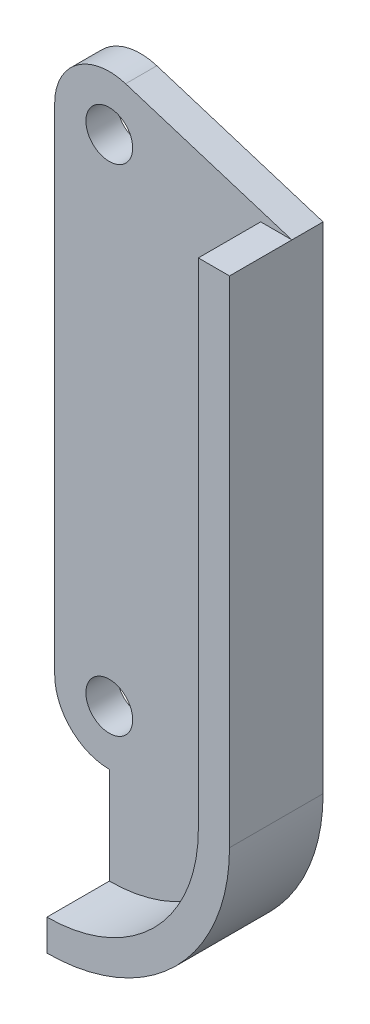
ISO-10303-21;
HEADER;
FILE_DESCRIPTION(('STEP AP214'),'2;1');
FILE_NAME('part.step','',(''),(''),'','','');
FILE_SCHEMA(('AUTOMOTIVE_DESIGN { 1 0 10303 214 1 1 1 1 }'));
ENDSEC;
DATA;
#1=APPLICATION_CONTEXT('core data for automotive mechanical design processes');
#2=APPLICATION_PROTOCOL_DEFINITION('international standard','automotive_design',2000,#1);
#3=PRODUCT_CONTEXT('',#1,'mechanical');
#4=PRODUCT('Part','Part','',(#3));
#5=PRODUCT_RELATED_PRODUCT_CATEGORY('part','',(#4));
#6=PRODUCT_DEFINITION_FORMATION('','',#4);
#7=PRODUCT_DEFINITION_CONTEXT('part definition',#1,'design');
#8=PRODUCT_DEFINITION('design','',#6,#7);
#9=PRODUCT_DEFINITION_SHAPE('','',#8);
#10=(LENGTH_UNIT() NAMED_UNIT(*) SI_UNIT(.MILLI.,.METRE.));
#11=(NAMED_UNIT(*) PLANE_ANGLE_UNIT() SI_UNIT($,.RADIAN.));
#12=(NAMED_UNIT(*) SI_UNIT($,.STERADIAN.) SOLID_ANGLE_UNIT());
#13=UNCERTAINTY_MEASURE_WITH_UNIT(LENGTH_MEASURE(1.E-05),#10,'distance_accuracy_value','');
#14=(GEOMETRIC_REPRESENTATION_CONTEXT(3) GLOBAL_UNCERTAINTY_ASSIGNED_CONTEXT((#13)) GLOBAL_UNIT_ASSIGNED_CONTEXT((#10,
#11,#12)) REPRESENTATION_CONTEXT('',''));
#15=CARTESIAN_POINT('',(0.,0.,0.));
#16=DIRECTION('',(0.,0.,1.));
#17=DIRECTION('',(1.,0.,0.));
#18=AXIS2_PLACEMENT_3D('',#15,#16,#17);
#19=CARTESIAN_POINT('',(-3.5,0.,2.));
#20=DIRECTION('',(1.,0.,0.));
#21=DIRECTION('',(0.,1.,0.));
#22=AXIS2_PLACEMENT_3D('',#19,#20,#21);
#23=PLANE('',#22);
#24=DIRECTION('',(0.,-1.,0.));
#25=VECTOR('',#24,1.);
#26=CARTESIAN_POINT('',(-3.5,0.,0.));
#27=LINE('',#26,#25);
#28=CARTESIAN_POINT('',(-3.5,31.75,0.));
#29=VERTEX_POINT('',#28);
#30=CARTESIAN_POINT('',(-3.5,0.,0.));
#31=VERTEX_POINT('',#30);
#32=EDGE_CURVE('E154',#29,#31,#27,.T.);
#33=ORIENTED_EDGE('',*,*,#32,.T.);
#34=DIRECTION('',(0.,0.,-1.));
#35=VECTOR('',#34,1.);
#36=CARTESIAN_POINT('',(-3.5,0.,2.));
#37=LINE('',#36,#35);
#38=CARTESIAN_POINT('',(-3.5,0.,2.));
#39=VERTEX_POINT('',#38);
#40=EDGE_CURVE('E11',#39,#31,#37,.T.);
#41=ORIENTED_EDGE('',*,*,#40,.F.);
#42=DIRECTION('',(0.,-1.,0.));
#43=VECTOR('',#42,1.);
#44=CARTESIAN_POINT('',(-3.5,0.,2.));
#45=LINE('',#44,#43);
#46=CARTESIAN_POINT('',(-3.5,31.75,2.));
#47=VERTEX_POINT('',#46);
#48=EDGE_CURVE('E165',#47,#39,#45,.T.);
#49=ORIENTED_EDGE('',*,*,#48,.F.);
#50=DIRECTION('',(0.,0.,-1.));
#51=VECTOR('',#50,1.);
#52=CARTESIAN_POINT('',(-3.5,31.75,2.));
#53=LINE('',#52,#51);
#54=EDGE_CURVE('E189',#47,#29,#53,.T.);
#55=ORIENTED_EDGE('',*,*,#54,.T.);
#56=EDGE_LOOP('',(#33,#41,#49,#55));
#57=FACE_BOUND('',#56,.T.);
#58=ADVANCED_FACE('F47',(#57),#23,.F.);
#59=CARTESIAN_POINT('',(0.,0.,2.));
#60=DIRECTION('',(0.,0.,-1.));
#61=DIRECTION('',(-1.,0.,0.));
#62=AXIS2_PLACEMENT_3D('',#59,#60,#61);
#63=CYLINDRICAL_SURFACE('',#62,3.5);
#64=CARTESIAN_POINT('',(0.,0.,0.));
#65=DIRECTION('',(0.,0.,1.));
#66=DIRECTION('',(1.,0.,0.));
#67=AXIS2_PLACEMENT_3D('',#64,#65,#66);
#68=CIRCLE('',#67,3.5);
#69=CARTESIAN_POINT('',(0.,-3.5,0.));
#70=VERTEX_POINT('',#69);
#71=EDGE_CURVE('E159',#31,#70,#68,.T.);
#72=ORIENTED_EDGE('',*,*,#71,.T.);
#73=DIRECTION('',(0.,0.,-1.));
#74=VECTOR('',#73,1.);
#75=CARTESIAN_POINT('',(0.,-3.5,2.));
#76=LINE('',#75,#74);
#77=CARTESIAN_POINT('',(0.,-3.5,2.));
#78=VERTEX_POINT('',#77);
#79=EDGE_CURVE('E55',#78,#70,#76,.T.);
#80=ORIENTED_EDGE('',*,*,#79,.F.);
#81=CARTESIAN_POINT('',(0.,0.,2.));
#82=DIRECTION('',(0.,0.,1.));
#83=DIRECTION('',(1.,0.,0.));
#84=AXIS2_PLACEMENT_3D('',#81,#82,#83);
#85=CIRCLE('',#84,3.5);
#86=EDGE_CURVE('E169',#39,#78,#85,.T.);
#87=ORIENTED_EDGE('',*,*,#86,.F.);
#88=ORIENTED_EDGE('',*,*,#40,.T.);
#89=EDGE_LOOP('',(#72,#80,#87,#88));
#90=FACE_BOUND('',#89,.T.);
#91=ADVANCED_FACE('F240',(#90),#63,.T.);
#92=CARTESIAN_POINT('',(0.,0.,2.));
#93=DIRECTION('',(-1.,0.,0.));
#94=DIRECTION('',(0.,0.,1.));
#95=AXIS2_PLACEMENT_3D('',#92,#93,#94);
#96=PLANE('',#95);
#97=DIRECTION('',(0.,1.,0.));
#98=VECTOR('',#97,1.);
#99=CARTESIAN_POINT('',(0.,0.,0.));
#100=LINE('',#99,#98);
#101=CARTESIAN_POINT('',(0.,-11.70788,0.));
#102=VERTEX_POINT('',#101);
#103=EDGE_CURVE('E194',#102,#70,#100,.T.);
#104=ORIENTED_EDGE('',*,*,#103,.F.);
#105=DIRECTION('',(0.,0.,-1.));
#106=VECTOR('',#105,1.);
#107=CARTESIAN_POINT('',(0.,-11.70788,2.));
#108=LINE('',#107,#106);
#109=CARTESIAN_POINT('',(0.,-11.70788,6.));
#110=VERTEX_POINT('',#109);
#111=EDGE_CURVE('E232',#110,#102,#108,.T.);
#112=ORIENTED_EDGE('',*,*,#111,.F.);
#113=DIRECTION('',(0.,-1.,0.));
#114=VECTOR('',#113,1.);
#115=CARTESIAN_POINT('',(0.,0.,6.));
#116=LINE('',#115,#114);
#117=CARTESIAN_POINT('',(0.,-9.70788,6.));
#118=VERTEX_POINT('',#117);
#119=EDGE_CURVE('E261',#118,#110,#116,.T.);
#120=ORIENTED_EDGE('',*,*,#119,.F.);
#121=DIRECTION('',(0.,0.,-1.));
#122=VECTOR('',#121,1.);
#123=CARTESIAN_POINT('',(0.,-9.70788,6.));
#124=LINE('',#123,#122);
#125=CARTESIAN_POINT('',(0.,-9.70788,2.));
#126=VERTEX_POINT('',#125);
#127=EDGE_CURVE('E161',#118,#126,#124,.T.);
#128=ORIENTED_EDGE('',*,*,#127,.T.);
#129=DIRECTION('',(0.,1.,0.));
#130=VECTOR('',#129,1.);
#131=CARTESIAN_POINT('',(0.,0.,2.));
#132=LINE('',#131,#130);
#133=EDGE_CURVE('E68',#126,#78,#132,.T.);
#134=ORIENTED_EDGE('',*,*,#133,.T.);
#135=ORIENTED_EDGE('',*,*,#79,.T.);
#136=EDGE_LOOP('',(#104,#112,#120,#128,#134,#135));
#137=FACE_BOUND('',#136,.T.);
#138=ADVANCED_FACE('F238',(#137),#96,.T.);
#139=CARTESIAN_POINT('',(0.,0.,2.));
#140=DIRECTION('',(0.,0.,-1.));
#141=DIRECTION('',(-1.,0.,0.));
#142=AXIS2_PLACEMENT_3D('',#139,#140,#141);
#143=CYLINDRICAL_SURFACE('',#142,11.70788);
#144=CARTESIAN_POINT('',(0.,0.,0.));
#145=DIRECTION('',(0.,0.,1.));
#146=DIRECTION('',(1.,0.,0.));
#147=AXIS2_PLACEMENT_3D('',#144,#145,#146);
#148=CIRCLE('',#147,11.70788);
#149=CARTESIAN_POINT('',(11.70788,0.,0.));
#150=VERTEX_POINT('',#149);
#151=EDGE_CURVE('E198',#102,#150,#148,.T.);
#152=ORIENTED_EDGE('',*,*,#151,.T.);
#153=DIRECTION('',(0.,0.,-1.));
#154=VECTOR('',#153,1.);
#155=CARTESIAN_POINT('',(11.70788,0.,2.));
#156=LINE('',#155,#154);
#157=CARTESIAN_POINT('',(11.70788,0.,6.));
#158=VERTEX_POINT('',#157);
#159=EDGE_CURVE('E228',#158,#150,#156,.T.);
#160=ORIENTED_EDGE('',*,*,#159,.F.);
#161=CARTESIAN_POINT('',(0.,0.,6.));
#162=DIRECTION('',(0.,0.,1.));
#163=DIRECTION('',(1.,0.,0.));
#164=AXIS2_PLACEMENT_3D('',#161,#162,#163);
#165=CIRCLE('',#164,11.70788);
#166=EDGE_CURVE('E256',#110,#158,#165,.T.);
#167=ORIENTED_EDGE('',*,*,#166,.F.);
#168=ORIENTED_EDGE('',*,*,#111,.T.);
#169=EDGE_LOOP('',(#152,#160,#167,#168));
#170=FACE_BOUND('',#169,.T.);
#171=ADVANCED_FACE('F249',(#170),#143,.T.);
#172=CARTESIAN_POINT('',(11.70788,0.,2.));
#173=DIRECTION('',(-1.,0.,0.));
#174=DIRECTION('',(0.,0.,1.));
#175=AXIS2_PLACEMENT_3D('',#172,#173,#174);
#176=PLANE('',#175);
#177=DIRECTION('',(0.,1.,0.));
#178=VECTOR('',#177,1.);
#179=CARTESIAN_POINT('',(11.70788,0.,0.));
#180=LINE('',#179,#178);
#181=CARTESIAN_POINT('',(11.70788,31.75,0.));
#182=VERTEX_POINT('',#181);
#183=EDGE_CURVE('E201',#150,#182,#180,.T.);
#184=ORIENTED_EDGE('',*,*,#183,.T.);
#185=DIRECTION('',(0.,0.,-1.));
#186=VECTOR('',#185,1.);
#187=CARTESIAN_POINT('',(11.70788,31.75,2.));
#188=LINE('',#187,#186);
#189=CARTESIAN_POINT('',(11.70788,31.75,2.));
#190=VERTEX_POINT('',#189);
#191=EDGE_CURVE('E225',#190,#182,#188,.T.);
#192=ORIENTED_EDGE('',*,*,#191,.F.);
#193=DIRECTION('',(0.,0.,-1.));
#194=VECTOR('',#193,1.);
#195=CARTESIAN_POINT('',(11.70788,31.75,6.));
#196=LINE('',#195,#194);
#197=CARTESIAN_POINT('',(11.70788,31.75,6.));
#198=VERTEX_POINT('',#197);
#199=EDGE_CURVE('E254',#198,#190,#196,.T.);
#200=ORIENTED_EDGE('',*,*,#199,.F.);
#201=DIRECTION('',(0.,-1.,0.));
#202=VECTOR('',#201,1.);
#203=CARTESIAN_POINT('',(11.70788,0.,6.));
#204=LINE('',#203,#202);
#205=EDGE_CURVE('E145',#198,#158,#204,.T.);
#206=ORIENTED_EDGE('',*,*,#205,.T.);
#207=ORIENTED_EDGE('',*,*,#159,.T.);
#208=EDGE_LOOP('',(#184,#192,#200,#206,#207));
#209=FACE_BOUND('',#208,.T.);
#210=ADVANCED_FACE('F252',(#209),#176,.F.);
#211=CARTESIAN_POINT('',(10.1037359512712,32.2525295113811,2.));
#212=DIRECTION('',(0.2989439591113,0.954270668788925,0.));
#213=DIRECTION('',(-0.954270668788925,0.2989439591113,0.));
#214=AXIS2_PLACEMENT_3D('',#211,#212,#213);
#215=PLANE('',#214);
#216=DIRECTION('',(0.954270668788925,-0.2989439591113,0.));
#217=VECTOR('',#216,1.);
#218=CARTESIAN_POINT('',(10.1037359512712,32.2525295113811,0.));
#219=LINE('',#218,#217);
#220=CARTESIAN_POINT('',(1.04630385688955,35.0899473407612,0.));
#221=VERTEX_POINT('',#220);
#222=EDGE_CURVE('E205',#221,#182,#219,.T.);
#223=ORIENTED_EDGE('',*,*,#222,.F.);
#224=DIRECTION('',(0.,0.,-1.));
#225=VECTOR('',#224,1.);
#226=CARTESIAN_POINT('',(1.04630385688955,35.0899473407612,2.));
#227=LINE('',#226,#225);
#228=CARTESIAN_POINT('',(1.04630385688955,35.0899473407612,2.));
#229=VERTEX_POINT('',#228);
#230=EDGE_CURVE('E222',#229,#221,#227,.T.);
#231=ORIENTED_EDGE('',*,*,#230,.F.);
#232=DIRECTION('',(0.954270668788925,-0.2989439591113,0.));
#233=VECTOR('',#232,1.);
#234=CARTESIAN_POINT('',(10.1037359512712,32.2525295113811,2.));
#235=LINE('',#234,#233);
#236=EDGE_CURVE('E175',#229,#190,#235,.T.);
#237=ORIENTED_EDGE('',*,*,#236,.T.);
#238=ORIENTED_EDGE('',*,*,#191,.T.);
#239=EDGE_LOOP('',(#223,#231,#237,#238));
#240=FACE_BOUND('',#239,.T.);
#241=ADVANCED_FACE('F310',(#240),#215,.T.);
#242=CARTESIAN_POINT('',(0.,31.75,2.));
#243=DIRECTION('',(0.,0.,-1.));
#244=DIRECTION('',(-1.,0.,0.));
#245=AXIS2_PLACEMENT_3D('',#242,#243,#244);
#246=CYLINDRICAL_SURFACE('',#245,1.5);
#247=CARTESIAN_POINT('',(0.,31.75,2.));
#248=DIRECTION('',(0.,0.,1.));
#249=DIRECTION('',(1.,0.,0.));
#250=AXIS2_PLACEMENT_3D('',#247,#248,#249);
#251=CIRCLE('',#250,1.5);
#252=CARTESIAN_POINT('',(1.5,31.75,2.));
#253=VERTEX_POINT('',#252);
#254=EDGE_CURVE('E182',#253,#253,#251,.T.);
#255=ORIENTED_EDGE('',*,*,#254,.T.);
#256=EDGE_LOOP('',(#255));
#257=FACE_BOUND('',#256,.T.);
#258=CARTESIAN_POINT('',(0.,31.75,0.));
#259=DIRECTION('',(0.,0.,1.));
#260=DIRECTION('',(1.,0.,0.));
#261=AXIS2_PLACEMENT_3D('',#258,#259,#260);
#262=CIRCLE('',#261,1.5);
#263=CARTESIAN_POINT('',(1.5,31.75,0.));
#264=VERTEX_POINT('',#263);
#265=EDGE_CURVE('E212',#264,#264,#262,.T.);
#266=ORIENTED_EDGE('',*,*,#265,.F.);
#267=EDGE_LOOP('',(#266));
#268=FACE_BOUND('',#267,.T.);
#269=ADVANCED_FACE('F313',(#257,#268),#246,.F.);
#270=CARTESIAN_POINT('',(0.,31.75,2.));
#271=DIRECTION('',(0.,0.,-1.));
#272=DIRECTION('',(-1.,0.,0.));
#273=AXIS2_PLACEMENT_3D('',#270,#271,#272);
#274=CYLINDRICAL_SURFACE('',#273,3.5);
#275=CARTESIAN_POINT('',(0.,31.75,0.));
#276=DIRECTION('',(0.,0.,1.));
#277=DIRECTION('',(1.,0.,0.));
#278=AXIS2_PLACEMENT_3D('',#275,#276,#277);
#279=CIRCLE('',#278,3.5);
#280=EDGE_CURVE('E209',#221,#29,#279,.T.);
#281=ORIENTED_EDGE('',*,*,#280,.T.);
#282=ORIENTED_EDGE('',*,*,#54,.F.);
#283=CARTESIAN_POINT('',(0.,31.75,2.));
#284=DIRECTION('',(0.,0.,1.));
#285=DIRECTION('',(1.,0.,0.));
#286=AXIS2_PLACEMENT_3D('',#283,#284,#285);
#287=CIRCLE('',#286,3.5);
#288=EDGE_CURVE('E179',#229,#47,#287,.T.);
#289=ORIENTED_EDGE('',*,*,#288,.F.);
#290=ORIENTED_EDGE('',*,*,#230,.T.);
#291=EDGE_LOOP('',(#281,#282,#289,#290));
#292=FACE_BOUND('',#291,.T.);
#293=ADVANCED_FACE('F288',(#292),#274,.T.);
#294=CARTESIAN_POINT('',(0.,0.,2.));
#295=DIRECTION('',(0.,0.,-1.));
#296=DIRECTION('',(-1.,0.,0.));
#297=AXIS2_PLACEMENT_3D('',#294,#295,#296);
#298=CYLINDRICAL_SURFACE('',#297,1.5);
#299=CARTESIAN_POINT('',(0.,0.,2.));
#300=DIRECTION('',(0.,0.,1.));
#301=DIRECTION('',(1.,0.,0.));
#302=AXIS2_PLACEMENT_3D('',#299,#300,#301);
#303=CIRCLE('',#302,1.5);
#304=CARTESIAN_POINT('',(1.5,0.,2.));
#305=VERTEX_POINT('',#304);
#306=EDGE_CURVE('E186',#305,#305,#303,.T.);
#307=ORIENTED_EDGE('',*,*,#306,.T.);
#308=EDGE_LOOP('',(#307));
#309=FACE_BOUND('',#308,.T.);
#310=CARTESIAN_POINT('',(0.,0.,0.));
#311=DIRECTION('',(0.,0.,1.));
#312=DIRECTION('',(1.,0.,0.));
#313=AXIS2_PLACEMENT_3D('',#310,#311,#312);
#314=CIRCLE('',#313,1.5);
#315=CARTESIAN_POINT('',(1.5,0.,0.));
#316=VERTEX_POINT('',#315);
#317=EDGE_CURVE('E170',#316,#316,#314,.T.);
#318=ORIENTED_EDGE('',*,*,#317,.F.);
#319=EDGE_LOOP('',(#318));
#320=FACE_BOUND('',#319,.T.);
#321=ADVANCED_FACE('F280',(#309,#320),#298,.F.);
#322=CARTESIAN_POINT('',(0.,0.,2.));
#323=DIRECTION('',(0.,0.,1.));
#324=DIRECTION('',(1.,0.,0.));
#325=AXIS2_PLACEMENT_3D('',#322,#323,#324);
#326=PLANE('',#325);
#327=DIRECTION('',(-1.,0.,0.));
#328=VECTOR('',#327,1.);
#329=CARTESIAN_POINT('',(0.,31.75,2.));
#330=LINE('',#329,#328);
#331=CARTESIAN_POINT('',(9.70788,31.75,2.));
#332=VERTEX_POINT('',#331);
#333=EDGE_CURVE('E152',#190,#332,#330,.T.);
#334=ORIENTED_EDGE('',*,*,#333,.F.);
#335=ORIENTED_EDGE('',*,*,#236,.F.);
#336=ORIENTED_EDGE('',*,*,#288,.T.);
#337=ORIENTED_EDGE('',*,*,#48,.T.);
#338=ORIENTED_EDGE('',*,*,#86,.T.);
#339=ORIENTED_EDGE('',*,*,#133,.F.);
#340=CARTESIAN_POINT('',(0.,0.,2.));
#341=DIRECTION('',(0.,0.,1.));
#342=DIRECTION('',(1.,0.,0.));
#343=AXIS2_PLACEMENT_3D('',#340,#341,#342);
#344=CIRCLE('',#343,9.70788);
#345=CARTESIAN_POINT('',(9.70788,0.,2.));
#346=VERTEX_POINT('',#345);
#347=EDGE_CURVE('E149',#126,#346,#344,.T.);
#348=ORIENTED_EDGE('',*,*,#347,.T.);
#349=DIRECTION('',(0.,-1.,0.));
#350=VECTOR('',#349,1.);
#351=CARTESIAN_POINT('',(9.70788,0.,2.));
#352=LINE('',#351,#350);
#353=EDGE_CURVE('E62',#332,#346,#352,.T.);
#354=ORIENTED_EDGE('',*,*,#353,.F.);
#355=EDGE_LOOP('',(#334,#335,#336,#337,#338,#339,#348,#354));
#356=FACE_BOUND('',#355,.T.);
#357=ORIENTED_EDGE('',*,*,#254,.F.);
#358=EDGE_LOOP('',(#357));
#359=FACE_BOUND('',#358,.T.);
#360=ORIENTED_EDGE('',*,*,#306,.F.);
#361=EDGE_LOOP('',(#360));
#362=FACE_BOUND('',#361,.T.);
#363=ADVANCED_FACE('F276',(#356,#359,#362),#326,.T.);
#364=CARTESIAN_POINT('',(0.,0.,0.));
#365=DIRECTION('',(0.,0.,1.));
#366=DIRECTION('',(1.,0.,0.));
#367=AXIS2_PLACEMENT_3D('',#364,#365,#366);
#368=PLANE('',#367);
#369=ORIENTED_EDGE('',*,*,#32,.F.);
#370=ORIENTED_EDGE('',*,*,#280,.F.);
#371=ORIENTED_EDGE('',*,*,#222,.T.);
#372=ORIENTED_EDGE('',*,*,#183,.F.);
#373=ORIENTED_EDGE('',*,*,#151,.F.);
#374=ORIENTED_EDGE('',*,*,#103,.T.);
#375=ORIENTED_EDGE('',*,*,#71,.F.);
#376=EDGE_LOOP('',(#369,#370,#371,#372,#373,#374,#375));
#377=FACE_BOUND('',#376,.T.);
#378=ORIENTED_EDGE('',*,*,#265,.T.);
#379=EDGE_LOOP('',(#378));
#380=FACE_BOUND('',#379,.T.);
#381=ORIENTED_EDGE('',*,*,#317,.T.);
#382=EDGE_LOOP('',(#381));
#383=FACE_BOUND('',#382,.T.);
#384=ADVANCED_FACE('F245',(#377,#380,#383),#368,.F.);
#385=CARTESIAN_POINT('',(0.,31.75,6.));
#386=DIRECTION('',(0.,-1.,0.));
#387=DIRECTION('',(0.,0.,-1.));
#388=AXIS2_PLACEMENT_3D('',#385,#386,#387);
#389=PLANE('',#388);
#390=ORIENTED_EDGE('',*,*,#333,.T.);
#391=DIRECTION('',(0.,0.,-1.));
#392=VECTOR('',#391,1.);
#393=CARTESIAN_POINT('',(9.70788,31.75,6.));
#394=LINE('',#393,#392);
#395=CARTESIAN_POINT('',(9.70788,31.75,6.));
#396=VERTEX_POINT('',#395);
#397=EDGE_CURVE('E129',#396,#332,#394,.T.);
#398=ORIENTED_EDGE('',*,*,#397,.F.);
#399=DIRECTION('',(-1.,0.,0.));
#400=VECTOR('',#399,1.);
#401=CARTESIAN_POINT('',(0.,31.75,6.));
#402=LINE('',#401,#400);
#403=EDGE_CURVE('E138',#198,#396,#402,.T.);
#404=ORIENTED_EDGE('',*,*,#403,.F.);
#405=ORIENTED_EDGE('',*,*,#199,.T.);
#406=EDGE_LOOP('',(#390,#398,#404,#405));
#407=FACE_BOUND('',#406,.T.);
#408=ADVANCED_FACE('F151',(#407),#389,.F.);
#409=CARTESIAN_POINT('',(9.70788,0.,6.));
#410=DIRECTION('',(1.,0.,0.));
#411=DIRECTION('',(0.,0.,-1.));
#412=AXIS2_PLACEMENT_3D('',#409,#410,#411);
#413=PLANE('',#412);
#414=ORIENTED_EDGE('',*,*,#353,.T.);
#415=DIRECTION('',(0.,0.,-1.));
#416=VECTOR('',#415,1.);
#417=CARTESIAN_POINT('',(9.70788,0.,6.));
#418=LINE('',#417,#416);
#419=CARTESIAN_POINT('',(9.70788,0.,6.));
#420=VERTEX_POINT('',#419);
#421=EDGE_CURVE('E132',#420,#346,#418,.T.);
#422=ORIENTED_EDGE('',*,*,#421,.F.);
#423=DIRECTION('',(0.,-1.,0.));
#424=VECTOR('',#423,1.);
#425=CARTESIAN_POINT('',(9.70788,0.,6.));
#426=LINE('',#425,#424);
#427=EDGE_CURVE('E125',#396,#420,#426,.T.);
#428=ORIENTED_EDGE('',*,*,#427,.F.);
#429=ORIENTED_EDGE('',*,*,#397,.T.);
#430=EDGE_LOOP('',(#414,#422,#428,#429));
#431=FACE_BOUND('',#430,.T.);
#432=ADVANCED_FACE('F127',(#431),#413,.F.);
#433=CARTESIAN_POINT('',(0.,0.,6.));
#434=DIRECTION('',(0.,0.,-1.));
#435=DIRECTION('',(-1.,0.,0.));
#436=AXIS2_PLACEMENT_3D('',#433,#434,#435);
#437=CYLINDRICAL_SURFACE('',#436,9.70788);
#438=ORIENTED_EDGE('',*,*,#347,.F.);
#439=ORIENTED_EDGE('',*,*,#127,.F.);
#440=CARTESIAN_POINT('',(0.,0.,6.));
#441=DIRECTION('',(0.,0.,1.));
#442=DIRECTION('',(1.,0.,0.));
#443=AXIS2_PLACEMENT_3D('',#440,#441,#442);
#444=CIRCLE('',#443,9.70788);
#445=EDGE_CURVE('E137',#118,#420,#444,.T.);
#446=ORIENTED_EDGE('',*,*,#445,.T.);
#447=ORIENTED_EDGE('',*,*,#421,.T.);
#448=EDGE_LOOP('',(#438,#439,#446,#447));
#449=FACE_BOUND('',#448,.T.);
#450=ADVANCED_FACE('F275',(#449),#437,.F.);
#451=CARTESIAN_POINT('',(0.,0.,6.));
#452=DIRECTION('',(0.,0.,1.));
#453=DIRECTION('',(1.,0.,0.));
#454=AXIS2_PLACEMENT_3D('',#451,#452,#453);
#455=PLANE('',#454);
#456=ORIENTED_EDGE('',*,*,#403,.T.);
#457=ORIENTED_EDGE('',*,*,#427,.T.);
#458=ORIENTED_EDGE('',*,*,#445,.F.);
#459=ORIENTED_EDGE('',*,*,#119,.T.);
#460=ORIENTED_EDGE('',*,*,#166,.T.);
#461=ORIENTED_EDGE('',*,*,#205,.F.);
#462=EDGE_LOOP('',(#456,#457,#458,#459,#460,#461));
#463=FACE_BOUND('',#462,.T.);
#464=ADVANCED_FACE('F142',(#463),#455,.T.);
#465=CLOSED_SHELL('',(#58,#91,#138,#171,#210,#241,#269,#293,#321,#363,#384,#408,#432,#450,#464));
#466=MANIFOLD_SOLID_BREP('B2',#465);
#467=ADVANCED_BREP_SHAPE_REPRESENTATION('',(#18,#466),#14);
#468=SHAPE_DEFINITION_REPRESENTATION(#9,#467);
ENDSEC;
END-ISO-10303-21;
